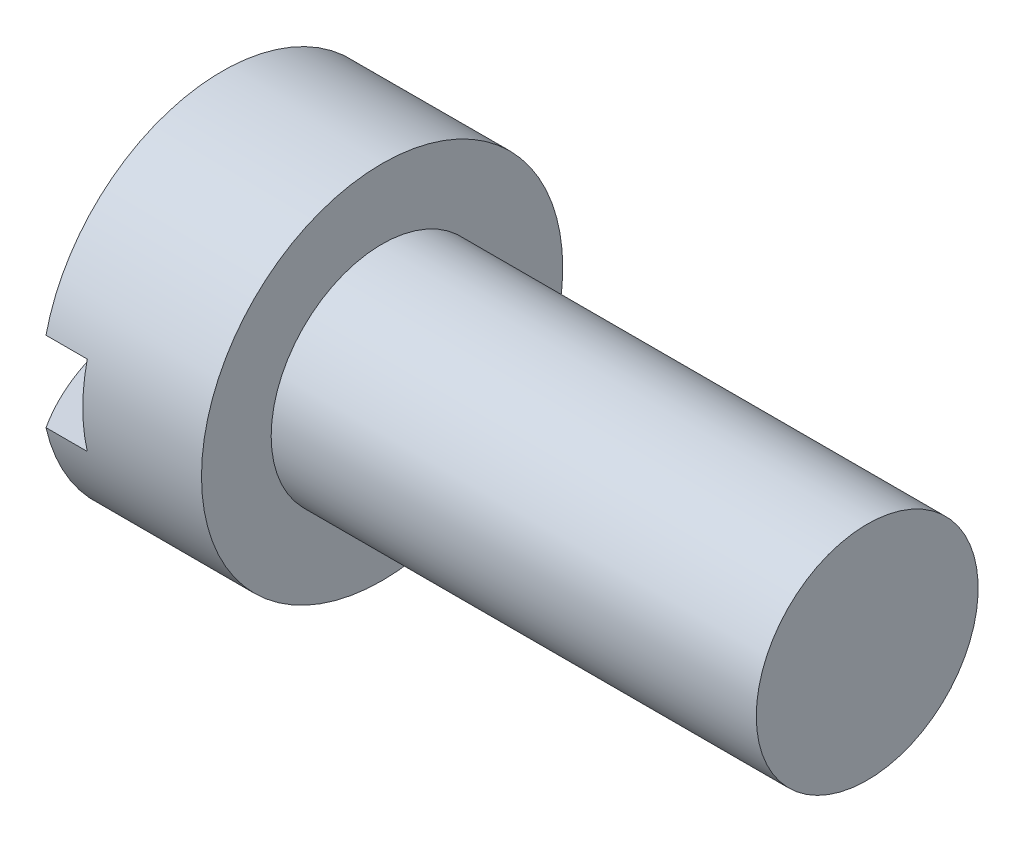
ISO-10303-21;
HEADER;
FILE_DESCRIPTION(('STEP AP214'),'2;1');
FILE_NAME('part.step','',(''),(''),'','','');
FILE_SCHEMA(('AUTOMOTIVE_DESIGN { 1 0 10303 214 1 1 1 1 }'));
ENDSEC;
DATA;
#1=APPLICATION_CONTEXT('core data for automotive mechanical design processes');
#2=APPLICATION_PROTOCOL_DEFINITION('international standard','automotive_design',2000,#1);
#3=PRODUCT_CONTEXT('',#1,'mechanical');
#4=PRODUCT('Part','Part','',(#3));
#5=PRODUCT_RELATED_PRODUCT_CATEGORY('part','',(#4));
#6=PRODUCT_DEFINITION_FORMATION('','',#4);
#7=PRODUCT_DEFINITION_CONTEXT('part definition',#1,'design');
#8=PRODUCT_DEFINITION('design','',#6,#7);
#9=PRODUCT_DEFINITION_SHAPE('','',#8);
#10=(LENGTH_UNIT() NAMED_UNIT(*) SI_UNIT(.MILLI.,.METRE.));
#11=(NAMED_UNIT(*) PLANE_ANGLE_UNIT() SI_UNIT($,.RADIAN.));
#12=(NAMED_UNIT(*) SI_UNIT($,.STERADIAN.) SOLID_ANGLE_UNIT());
#13=UNCERTAINTY_MEASURE_WITH_UNIT(LENGTH_MEASURE(1.E-05),#10,'distance_accuracy_value','');
#14=(GEOMETRIC_REPRESENTATION_CONTEXT(3) GLOBAL_UNCERTAINTY_ASSIGNED_CONTEXT((#13)) GLOBAL_UNIT_ASSIGNED_CONTEXT((#10,
#11,#12)) REPRESENTATION_CONTEXT('',''));
#15=CARTESIAN_POINT('',(0.,0.,0.));
#16=DIRECTION('',(0.,0.,1.));
#17=DIRECTION('',(1.,0.,0.));
#18=AXIS2_PLACEMENT_3D('',#15,#16,#17);
#19=CARTESIAN_POINT('',(3.23003333333336,0.,0.));
#20=DIRECTION('',(-1.,0.,0.));
#21=DIRECTION('',(0.,1.,0.));
#22=AXIS2_PLACEMENT_3D('',#19,#20,#21);
#23=SPHERICAL_SURFACE('',#22,3.23003333333336);
#24=CARTESIAN_POINT('',(0.5334,0.,0.));
#25=DIRECTION('',(-1.,0.,0.));
#26=DIRECTION('',(0.,0.,1.));
#27=AXIS2_PLACEMENT_3D('',#24,#25,#26);
#28=CIRCLE('',#27,1.778);
#29=CARTESIAN_POINT('',(0.5334,-0.393700000000001,-1.73386398255458));
#30=VERTEX_POINT('',#29);
#31=CARTESIAN_POINT('',(0.5334,-0.393700000000001,1.73386398255457));
#32=VERTEX_POINT('',#31);
#33=EDGE_CURVE('E86',#30,#32,#28,.T.);
#34=ORIENTED_EDGE('',*,*,#33,.T.);
#35=CARTESIAN_POINT('',(3.23003333333336,-0.393700000000001,0.));
#36=DIRECTION('',(0.,1.,0.));
#37=DIRECTION('',(0.,0.,1.));
#38=AXIS2_PLACEMENT_3D('',#35,#36,#37);
#39=CIRCLE('',#38,3.20595003773368);
#40=EDGE_CURVE('E110',#32,#30,#39,.F.);
#41=ORIENTED_EDGE('',*,*,#40,.T.);
#42=EDGE_LOOP('',(#34,#41));
#43=FACE_BOUND('',#42,.T.);
#44=ADVANCED_FACE('F32',(#43),#23,.T.);
#45=CARTESIAN_POINT('',(0.5334,0.393699999999999,1.73386398255457));
#46=VERTEX_POINT('',#45);
#47=CARTESIAN_POINT('',(0.5334,0.393699999999999,-1.73386398255457));
#48=VERTEX_POINT('',#47);
#49=EDGE_CURVE('E88',#46,#48,#28,.T.);
#50=ORIENTED_EDGE('',*,*,#49,.T.);
#51=CARTESIAN_POINT('',(3.23003333333336,0.393699999999999,0.));
#52=DIRECTION('',(0.,-1.,0.));
#53=DIRECTION('',(0.,0.,-1.));
#54=AXIS2_PLACEMENT_3D('',#51,#52,#53);
#55=CIRCLE('',#54,3.20595003773368);
#56=EDGE_CURVE('E106',#48,#46,#55,.F.);
#57=ORIENTED_EDGE('',*,*,#56,.T.);
#58=EDGE_LOOP('',(#50,#57));
#59=FACE_BOUND('',#58,.T.);
#60=ADVANCED_FACE('F109',(#59),#23,.T.);
#61=CARTESIAN_POINT('',(-9.6035219818873,0.,0.));
#62=DIRECTION('',(-1.,0.,0.));
#63=DIRECTION('',(0.,0.,1.));
#64=AXIS2_PLACEMENT_3D('',#61,#62,#63);
#65=CYLINDRICAL_SURFACE('',#64,1.778);
#66=CARTESIAN_POINT('',(2.1082,0.,0.));
#67=DIRECTION('',(-1.,0.,0.));
#68=DIRECTION('',(0.,0.,1.));
#69=AXIS2_PLACEMENT_3D('',#66,#67,#68);
#70=CIRCLE('',#69,1.778);
#71=CARTESIAN_POINT('',(2.1082,0.,1.778));
#72=VERTEX_POINT('',#71);
#73=EDGE_CURVE('E89',#72,#72,#70,.T.);
#74=ORIENTED_EDGE('',*,*,#73,.T.);
#75=EDGE_LOOP('',(#74));
#76=FACE_BOUND('',#75,.T.);
#77=DIRECTION('',(-1.,0.,0.));
#78=VECTOR('',#77,1.);
#79=CARTESIAN_POINT('',(-9.6035219818873,-0.393700000000001,-1.73386398255457));
#80=LINE('',#79,#78);
#81=CARTESIAN_POINT('',(0.939799999999999,-0.393700000000001,-1.73386398255457));
#82=VERTEX_POINT('',#81);
#83=EDGE_CURVE('E11',#82,#30,#80,.T.);
#84=ORIENTED_EDGE('',*,*,#83,.F.);
#85=CARTESIAN_POINT('',(0.939799999999999,0.,0.));
#86=DIRECTION('',(-1.,0.,0.));
#87=DIRECTION('',(0.,0.,1.));
#88=AXIS2_PLACEMENT_3D('',#85,#86,#87);
#89=CIRCLE('',#88,1.778);
#90=CARTESIAN_POINT('',(0.939799999999999,0.393699999999999,-1.73386398255457));
#91=VERTEX_POINT('',#90);
#92=EDGE_CURVE('E69',#91,#82,#89,.T.);
#93=ORIENTED_EDGE('',*,*,#92,.F.);
#94=DIRECTION('',(-1.,0.,0.));
#95=VECTOR('',#94,1.);
#96=CARTESIAN_POINT('',(-9.6035219818873,0.393699999999999,-1.73386398255457));
#97=LINE('',#96,#95);
#98=EDGE_CURVE('E40',#48,#91,#97,.F.);
#99=ORIENTED_EDGE('',*,*,#98,.F.);
#100=ORIENTED_EDGE('',*,*,#49,.F.);
#101=DIRECTION('',(-1.,0.,0.));
#102=VECTOR('',#101,1.);
#103=CARTESIAN_POINT('',(-9.6035219818873,0.393699999999999,1.73386398255457));
#104=LINE('',#103,#102);
#105=CARTESIAN_POINT('',(0.939799999999999,0.393699999999999,1.73386398255457));
#106=VERTEX_POINT('',#105);
#107=EDGE_CURVE('E100',#106,#46,#104,.T.);
#108=ORIENTED_EDGE('',*,*,#107,.F.);
#109=CARTESIAN_POINT('',(0.939799999999999,-0.393700000000001,1.73386398255457));
#110=VERTEX_POINT('',#109);
#111=EDGE_CURVE('E78',#110,#106,#89,.T.);
#112=ORIENTED_EDGE('',*,*,#111,.F.);
#113=DIRECTION('',(-1.,0.,0.));
#114=VECTOR('',#113,1.);
#115=CARTESIAN_POINT('',(-9.6035219818873,-0.393700000000001,1.73386398255457));
#116=LINE('',#115,#114);
#117=EDGE_CURVE('E76',#32,#110,#116,.F.);
#118=ORIENTED_EDGE('',*,*,#117,.F.);
#119=ORIENTED_EDGE('',*,*,#33,.F.);
#120=EDGE_LOOP('',(#84,#93,#99,#100,#108,#112,#118,#119));
#121=FACE_BOUND('',#120,.T.);
#122=ADVANCED_FACE('F84',(#76,#121),#65,.T.);
#123=CARTESIAN_POINT('',(-9.6035219818873,0.,0.));
#124=DIRECTION('',(-1.,0.,0.));
#125=DIRECTION('',(0.,0.,1.));
#126=AXIS2_PLACEMENT_3D('',#123,#124,#125);
#127=CYLINDRICAL_SURFACE('',#126,1.0922);
#128=CARTESIAN_POINT('',(6.8834,0.,0.));
#129=DIRECTION('',(-1.,0.,0.));
#130=DIRECTION('',(0.,0.,1.));
#131=AXIS2_PLACEMENT_3D('',#128,#129,#130);
#132=CIRCLE('',#131,1.0922);
#133=CARTESIAN_POINT('',(6.8834,0.,1.0922));
#134=VERTEX_POINT('',#133);
#135=EDGE_CURVE('E92',#134,#134,#132,.T.);
#136=ORIENTED_EDGE('',*,*,#135,.T.);
#137=EDGE_LOOP('',(#136));
#138=FACE_BOUND('',#137,.T.);
#139=CARTESIAN_POINT('',(2.1082,0.,0.));
#140=DIRECTION('',(-1.,0.,0.));
#141=DIRECTION('',(0.,0.,1.));
#142=AXIS2_PLACEMENT_3D('',#139,#140,#141);
#143=CIRCLE('',#142,1.0922);
#144=CARTESIAN_POINT('',(2.1082,0.,1.0922));
#145=VERTEX_POINT('',#144);
#146=EDGE_CURVE('E94',#145,#145,#143,.T.);
#147=ORIENTED_EDGE('',*,*,#146,.F.);
#148=EDGE_LOOP('',(#147));
#149=FACE_BOUND('',#148,.T.);
#150=ADVANCED_FACE('F34',(#138,#149),#127,.T.);
#151=CARTESIAN_POINT('',(6.8834,1.0922,0.));
#152=DIRECTION('',(1.,0.,0.));
#153=DIRECTION('',(0.,0.,-1.));
#154=AXIS2_PLACEMENT_3D('',#151,#152,#153);
#155=PLANE('',#154);
#156=ORIENTED_EDGE('',*,*,#135,.F.);
#157=EDGE_LOOP('',(#156));
#158=FACE_BOUND('',#157,.T.);
#159=ADVANCED_FACE('F120',(#158),#155,.T.);
#160=CARTESIAN_POINT('',(2.1082,1.0922,0.));
#161=DIRECTION('',(-1.,0.,0.));
#162=DIRECTION('',(0.,0.,1.));
#163=AXIS2_PLACEMENT_3D('',#160,#161,#162);
#164=PLANE('',#163);
#165=ORIENTED_EDGE('',*,*,#73,.F.);
#166=EDGE_LOOP('',(#165));
#167=FACE_BOUND('',#166,.T.);
#168=ORIENTED_EDGE('',*,*,#146,.T.);
#169=EDGE_LOOP('',(#168));
#170=FACE_BOUND('',#169,.T.);
#171=ADVANCED_FACE('F117',(#167,#170),#164,.F.);
#172=CARTESIAN_POINT('',(0.9398,-0.393700000000001,-1.778));
#173=DIRECTION('',(0.,1.,0.));
#174=DIRECTION('',(0.,0.,1.));
#175=AXIS2_PLACEMENT_3D('',#172,#173,#174);
#176=PLANE('',#175);
#177=ORIENTED_EDGE('',*,*,#83,.T.);
#178=ORIENTED_EDGE('',*,*,#40,.F.);
#179=ORIENTED_EDGE('',*,*,#117,.T.);
#180=DIRECTION('',(0.,0.,-1.));
#181=VECTOR('',#180,1.);
#182=CARTESIAN_POINT('',(0.9398,-0.393700000000001,-1.778));
#183=LINE('',#182,#181);
#184=EDGE_CURVE('E47',#110,#82,#183,.T.);
#185=ORIENTED_EDGE('',*,*,#184,.T.);
#186=EDGE_LOOP('',(#177,#178,#179,#185));
#187=FACE_BOUND('',#186,.T.);
#188=ADVANCED_FACE('F79',(#187),#176,.T.);
#189=CARTESIAN_POINT('',(0.9398,0.393699999999999,1.778));
#190=DIRECTION('',(0.,-1.,0.));
#191=DIRECTION('',(0.,0.,-1.));
#192=AXIS2_PLACEMENT_3D('',#189,#190,#191);
#193=PLANE('',#192);
#194=ORIENTED_EDGE('',*,*,#107,.T.);
#195=ORIENTED_EDGE('',*,*,#56,.F.);
#196=ORIENTED_EDGE('',*,*,#98,.T.);
#197=DIRECTION('',(0.,0.,1.));
#198=VECTOR('',#197,1.);
#199=CARTESIAN_POINT('',(0.9398,0.393699999999999,1.778));
#200=LINE('',#199,#198);
#201=EDGE_CURVE('E72',#91,#106,#200,.T.);
#202=ORIENTED_EDGE('',*,*,#201,.T.);
#203=EDGE_LOOP('',(#194,#195,#196,#202));
#204=FACE_BOUND('',#203,.T.);
#205=ADVANCED_FACE('F103',(#204),#193,.T.);
#206=CARTESIAN_POINT('',(0.9398,-0.393700000000001,1.778));
#207=DIRECTION('',(-1.,0.,0.));
#208=DIRECTION('',(0.,0.,1.));
#209=AXIS2_PLACEMENT_3D('',#206,#207,#208);
#210=PLANE('',#209);
#211=ORIENTED_EDGE('',*,*,#201,.F.);
#212=ORIENTED_EDGE('',*,*,#92,.T.);
#213=ORIENTED_EDGE('',*,*,#184,.F.);
#214=ORIENTED_EDGE('',*,*,#111,.T.);
#215=EDGE_LOOP('',(#211,#212,#213,#214));
#216=FACE_BOUND('',#215,.T.);
#217=ADVANCED_FACE('F70',(#216),#210,.T.);
#218=CLOSED_SHELL('',(#44,#60,#122,#150,#159,#171,#188,#205,#217));
#219=MANIFOLD_SOLID_BREP('B2',#218);
#220=ADVANCED_BREP_SHAPE_REPRESENTATION('',(#18,#219),#14);
#221=SHAPE_DEFINITION_REPRESENTATION(#9,#220);
ENDSEC;
END-ISO-10303-21;
